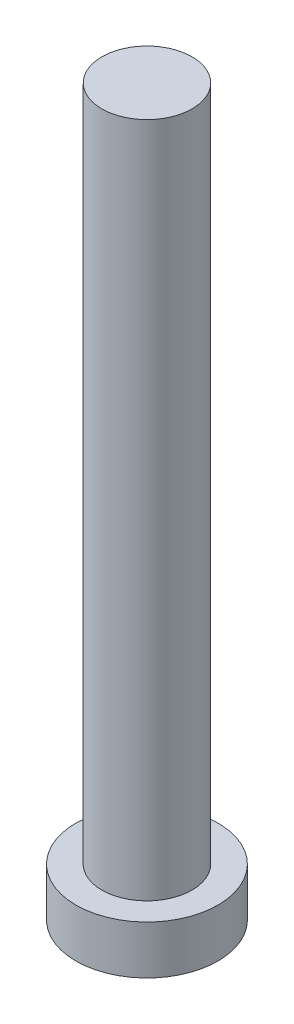
ISO-10303-21;
HEADER;
FILE_DESCRIPTION(('STEP AP214'),'2;1');
FILE_NAME('part.step','',(''),(''),'','','');
FILE_SCHEMA(('AUTOMOTIVE_DESIGN { 1 0 10303 214 1 1 1 1 }'));
ENDSEC;
DATA;
#1=APPLICATION_CONTEXT('core data for automotive mechanical design processes');
#2=APPLICATION_PROTOCOL_DEFINITION('international standard','automotive_design',2000,#1);
#3=PRODUCT_CONTEXT('',#1,'mechanical');
#4=PRODUCT('Part','Part','',(#3));
#5=PRODUCT_RELATED_PRODUCT_CATEGORY('part','',(#4));
#6=PRODUCT_DEFINITION_FORMATION('','',#4);
#7=PRODUCT_DEFINITION_CONTEXT('part definition',#1,'design');
#8=PRODUCT_DEFINITION('design','',#6,#7);
#9=PRODUCT_DEFINITION_SHAPE('','',#8);
#10=(LENGTH_UNIT() NAMED_UNIT(*) SI_UNIT(.MILLI.,.METRE.));
#11=(NAMED_UNIT(*) PLANE_ANGLE_UNIT() SI_UNIT($,.RADIAN.));
#12=(NAMED_UNIT(*) SI_UNIT($,.STERADIAN.) SOLID_ANGLE_UNIT());
#13=UNCERTAINTY_MEASURE_WITH_UNIT(LENGTH_MEASURE(1.E-05),#10,'distance_accuracy_value','');
#14=(GEOMETRIC_REPRESENTATION_CONTEXT(3) GLOBAL_UNCERTAINTY_ASSIGNED_CONTEXT((#13)) GLOBAL_UNIT_ASSIGNED_CONTEXT((#10,
#11,#12)) REPRESENTATION_CONTEXT('',''));
#15=CARTESIAN_POINT('',(0.,0.,0.));
#16=DIRECTION('',(0.,0.,1.));
#17=DIRECTION('',(1.,0.,0.));
#18=AXIS2_PLACEMENT_3D('',#15,#16,#17);
#19=CARTESIAN_POINT('',(0.,0.,0.));
#20=DIRECTION('',(0.,1.,0.));
#21=DIRECTION('',(0.,0.,1.));
#22=AXIS2_PLACEMENT_3D('',#19,#20,#21);
#23=PLANE('',#22);
#24=CARTESIAN_POINT('',(0.,0.,0.));
#25=DIRECTION('',(0.,1.,0.));
#26=DIRECTION('',(0.,0.,1.));
#27=AXIS2_PLACEMENT_3D('',#24,#25,#26);
#28=CIRCLE('',#27,3.15);
#29=CARTESIAN_POINT('',(0.,0.,3.15));
#30=VERTEX_POINT('',#29);
#31=EDGE_CURVE('E39',#30,#30,#28,.T.);
#32=ORIENTED_EDGE('',*,*,#31,.F.);
#33=EDGE_LOOP('',(#32));
#34=FACE_BOUND('',#33,.T.);
#35=CARTESIAN_POINT('',(1.,0.,1.));
#36=DIRECTION('',(0.,1.,0.));
#37=DIRECTION('',(0.,0.,-1.));
#38=AXIS2_PLACEMENT_3D('',#35,#36,#37);
#39=CIRCLE('',#38,0.5);
#40=CARTESIAN_POINT('',(1.,0.,0.5));
#41=VERTEX_POINT('',#40);
#42=CARTESIAN_POINT('',(0.5,0.,1.));
#43=VERTEX_POINT('',#42);
#44=EDGE_CURVE('E186',#41,#43,#39,.T.);
#45=ORIENTED_EDGE('',*,*,#44,.F.);
#46=DIRECTION('',(-1.,0.,0.));
#47=VECTOR('',#46,1.);
#48=CARTESIAN_POINT('',(1.,0.,0.5));
#49=LINE('',#48,#47);
#50=CARTESIAN_POINT('',(2.,0.,0.5));
#51=VERTEX_POINT('',#50);
#52=EDGE_CURVE('E52',#51,#41,#49,.T.);
#53=ORIENTED_EDGE('',*,*,#52,.F.);
#54=DIRECTION('',(0.,0.,1.));
#55=VECTOR('',#54,1.);
#56=CARTESIAN_POINT('',(2.,0.,-0.5));
#57=LINE('',#56,#55);
#58=CARTESIAN_POINT('',(2.,0.,-0.5));
#59=VERTEX_POINT('',#58);
#60=EDGE_CURVE('E225',#59,#51,#57,.T.);
#61=ORIENTED_EDGE('',*,*,#60,.F.);
#62=DIRECTION('',(1.,0.,0.));
#63=VECTOR('',#62,1.);
#64=CARTESIAN_POINT('',(1.,0.,-0.5));
#65=LINE('',#64,#63);
#66=CARTESIAN_POINT('',(1.,0.,-0.5));
#67=VERTEX_POINT('',#66);
#68=EDGE_CURVE('E223',#67,#59,#65,.T.);
#69=ORIENTED_EDGE('',*,*,#68,.F.);
#70=CARTESIAN_POINT('',(1.,0.,-1.));
#71=DIRECTION('',(0.,1.,0.));
#72=DIRECTION('',(0.,0.,-1.));
#73=AXIS2_PLACEMENT_3D('',#70,#71,#72);
#74=CIRCLE('',#73,0.5);
#75=CARTESIAN_POINT('',(0.500000000000001,0.,-1.));
#76=VERTEX_POINT('',#75);
#77=EDGE_CURVE('E160',#76,#67,#74,.T.);
#78=ORIENTED_EDGE('',*,*,#77,.F.);
#79=DIRECTION('',(0.,0.,1.));
#80=VECTOR('',#79,1.);
#81=CARTESIAN_POINT('',(0.500000000000001,0.,-2.));
#82=LINE('',#81,#80);
#83=CARTESIAN_POINT('',(0.500000000000001,0.,-2.));
#84=VERTEX_POINT('',#83);
#85=EDGE_CURVE('E219',#84,#76,#82,.T.);
#86=ORIENTED_EDGE('',*,*,#85,.F.);
#87=DIRECTION('',(1.,0.,0.));
#88=VECTOR('',#87,1.);
#89=CARTESIAN_POINT('',(-0.5,0.,-2.));
#90=LINE('',#89,#88);
#91=CARTESIAN_POINT('',(-0.5,0.,-2.));
#92=VERTEX_POINT('',#91);
#93=EDGE_CURVE('E216',#92,#84,#90,.T.);
#94=ORIENTED_EDGE('',*,*,#93,.F.);
#95=DIRECTION('',(0.,0.,-1.));
#96=VECTOR('',#95,1.);
#97=CARTESIAN_POINT('',(-0.5,0.,-2.));
#98=LINE('',#97,#96);
#99=CARTESIAN_POINT('',(-0.5,0.,-1.));
#100=VERTEX_POINT('',#99);
#101=EDGE_CURVE('E213',#100,#92,#98,.T.);
#102=ORIENTED_EDGE('',*,*,#101,.F.);
#103=CARTESIAN_POINT('',(-1.,0.,-1.));
#104=DIRECTION('',(0.,1.,0.));
#105=DIRECTION('',(0.,0.,-1.));
#106=AXIS2_PLACEMENT_3D('',#103,#104,#105);
#107=CIRCLE('',#106,0.5);
#108=CARTESIAN_POINT('',(-1.,0.,-0.5));
#109=VERTEX_POINT('',#108);
#110=EDGE_CURVE('E210',#109,#100,#107,.T.);
#111=ORIENTED_EDGE('',*,*,#110,.F.);
#112=DIRECTION('',(1.,0.,0.));
#113=VECTOR('',#112,1.);
#114=CARTESIAN_POINT('',(-2.,0.,-0.5));
#115=LINE('',#114,#113);
#116=CARTESIAN_POINT('',(-2.,0.,-0.5));
#117=VERTEX_POINT('',#116);
#118=EDGE_CURVE('E207',#117,#109,#115,.T.);
#119=ORIENTED_EDGE('',*,*,#118,.F.);
#120=DIRECTION('',(0.,0.,-1.));
#121=VECTOR('',#120,1.);
#122=CARTESIAN_POINT('',(-2.,0.,-0.5));
#123=LINE('',#122,#121);
#124=CARTESIAN_POINT('',(-2.,0.,0.5));
#125=VERTEX_POINT('',#124);
#126=EDGE_CURVE('E204',#125,#117,#123,.T.);
#127=ORIENTED_EDGE('',*,*,#126,.F.);
#128=DIRECTION('',(-1.,0.,0.));
#129=VECTOR('',#128,1.);
#130=CARTESIAN_POINT('',(-2.,0.,0.5));
#131=LINE('',#130,#129);
#132=CARTESIAN_POINT('',(-1.,0.,0.5));
#133=VERTEX_POINT('',#132);
#134=EDGE_CURVE('E201',#133,#125,#131,.T.);
#135=ORIENTED_EDGE('',*,*,#134,.F.);
#136=CARTESIAN_POINT('',(-1.,0.,1.));
#137=DIRECTION('',(0.,1.,0.));
#138=DIRECTION('',(0.,0.,1.));
#139=AXIS2_PLACEMENT_3D('',#136,#137,#138);
#140=CIRCLE('',#139,0.5);
#141=CARTESIAN_POINT('',(-0.5,0.,1.));
#142=VERTEX_POINT('',#141);
#143=EDGE_CURVE('E198',#142,#133,#140,.T.);
#144=ORIENTED_EDGE('',*,*,#143,.F.);
#145=DIRECTION('',(0.,0.,-1.));
#146=VECTOR('',#145,1.);
#147=CARTESIAN_POINT('',(-0.5,0.,1.));
#148=LINE('',#147,#146);
#149=CARTESIAN_POINT('',(-0.5,0.,2.));
#150=VERTEX_POINT('',#149);
#151=EDGE_CURVE('E195',#150,#142,#148,.T.);
#152=ORIENTED_EDGE('',*,*,#151,.F.);
#153=DIRECTION('',(-1.,0.,0.));
#154=VECTOR('',#153,1.);
#155=CARTESIAN_POINT('',(-0.5,0.,2.));
#156=LINE('',#155,#154);
#157=CARTESIAN_POINT('',(0.500000000000001,0.,2.));
#158=VERTEX_POINT('',#157);
#159=EDGE_CURVE('E192',#158,#150,#156,.T.);
#160=ORIENTED_EDGE('',*,*,#159,.F.);
#161=DIRECTION('',(0.,0.,1.));
#162=VECTOR('',#161,1.);
#163=CARTESIAN_POINT('',(0.5,0.,1.));
#164=LINE('',#163,#162);
#165=EDGE_CURVE('E189',#43,#158,#164,.T.);
#166=ORIENTED_EDGE('',*,*,#165,.F.);
#167=EDGE_LOOP('',(#45,#53,#61,#69,#78,#86,#94,#102,#111,#119,#127,#135,#144,#152,#160,#166));
#168=FACE_BOUND('',#167,.T.);
#169=ADVANCED_FACE('F35',(#34,#168),#23,.F.);
#170=CARTESIAN_POINT('',(0.,2.15,0.));
#171=DIRECTION('',(0.,-1.,0.));
#172=DIRECTION('',(0.,0.,-1.));
#173=AXIS2_PLACEMENT_3D('',#170,#171,#172);
#174=CYLINDRICAL_SURFACE('',#173,3.15);
#175=CARTESIAN_POINT('',(0.,2.15,0.));
#176=DIRECTION('',(0.,1.,0.));
#177=DIRECTION('',(0.,0.,1.));
#178=AXIS2_PLACEMENT_3D('',#175,#176,#177);
#179=CIRCLE('',#178,3.15);
#180=CARTESIAN_POINT('',(0.,2.15,3.15));
#181=VERTEX_POINT('',#180);
#182=EDGE_CURVE('E44',#181,#181,#179,.T.);
#183=ORIENTED_EDGE('',*,*,#182,.F.);
#184=EDGE_LOOP('',(#183));
#185=FACE_BOUND('',#184,.T.);
#186=ORIENTED_EDGE('',*,*,#31,.T.);
#187=EDGE_LOOP('',(#186));
#188=FACE_BOUND('',#187,.T.);
#189=ADVANCED_FACE('F37',(#185,#188),#174,.T.);
#190=CARTESIAN_POINT('',(0.,2.15,0.));
#191=DIRECTION('',(0.,1.,0.));
#192=DIRECTION('',(0.,0.,1.));
#193=AXIS2_PLACEMENT_3D('',#190,#191,#192);
#194=PLANE('',#193);
#195=CARTESIAN_POINT('',(0.,2.15,0.));
#196=DIRECTION('',(0.,1.,0.));
#197=DIRECTION('',(0.,0.,1.));
#198=AXIS2_PLACEMENT_3D('',#195,#196,#197);
#199=CIRCLE('',#198,2.);
#200=CARTESIAN_POINT('',(0.,2.15,2.));
#201=VERTEX_POINT('',#200);
#202=EDGE_CURVE('E11',#201,#201,#199,.T.);
#203=ORIENTED_EDGE('',*,*,#202,.F.);
#204=EDGE_LOOP('',(#203));
#205=FACE_BOUND('',#204,.T.);
#206=ORIENTED_EDGE('',*,*,#182,.T.);
#207=EDGE_LOOP('',(#206));
#208=FACE_BOUND('',#207,.T.);
#209=ADVANCED_FACE('F374',(#205,#208),#194,.T.);
#210=CARTESIAN_POINT('',(0.,32.15,0.));
#211=DIRECTION('',(0.,-1.,0.));
#212=DIRECTION('',(0.,0.,-1.));
#213=AXIS2_PLACEMENT_3D('',#210,#211,#212);
#214=CYLINDRICAL_SURFACE('',#213,2.);
#215=CARTESIAN_POINT('',(0.,32.15,0.));
#216=DIRECTION('',(0.,1.,0.));
#217=DIRECTION('',(0.,0.,1.));
#218=AXIS2_PLACEMENT_3D('',#215,#216,#217);
#219=CIRCLE('',#218,2.);
#220=CARTESIAN_POINT('',(0.,32.15,2.));
#221=VERTEX_POINT('',#220);
#222=EDGE_CURVE('E229',#221,#221,#219,.T.);
#223=ORIENTED_EDGE('',*,*,#222,.F.);
#224=EDGE_LOOP('',(#223));
#225=FACE_BOUND('',#224,.T.);
#226=ORIENTED_EDGE('',*,*,#202,.T.);
#227=EDGE_LOOP('',(#226));
#228=FACE_BOUND('',#227,.T.);
#229=ADVANCED_FACE('F370',(#225,#228),#214,.T.);
#230=CARTESIAN_POINT('',(0.,32.15,0.));
#231=DIRECTION('',(0.,1.,0.));
#232=DIRECTION('',(0.,0.,1.));
#233=AXIS2_PLACEMENT_3D('',#230,#231,#232);
#234=PLANE('',#233);
#235=ORIENTED_EDGE('',*,*,#222,.T.);
#236=EDGE_LOOP('',(#235));
#237=FACE_BOUND('',#236,.T.);
#238=ADVANCED_FACE('F320',(#237),#234,.T.);
#239=CARTESIAN_POINT('',(1.,1.5,0.5));
#240=DIRECTION('',(0.,0.,1.));
#241=DIRECTION('',(1.,0.,0.));
#242=AXIS2_PLACEMENT_3D('',#239,#240,#241);
#243=PLANE('',#242);
#244=ORIENTED_EDGE('',*,*,#52,.T.);
#245=DIRECTION('',(0.,-1.,0.));
#246=VECTOR('',#245,1.);
#247=CARTESIAN_POINT('',(1.,1.5,0.5));
#248=LINE('',#247,#246);
#249=CARTESIAN_POINT('',(1.,1.5,0.5));
#250=VERTEX_POINT('',#249);
#251=EDGE_CURVE('E112',#250,#41,#248,.T.);
#252=ORIENTED_EDGE('',*,*,#251,.F.);
#253=DIRECTION('',(-1.,0.,0.));
#254=VECTOR('',#253,1.);
#255=CARTESIAN_POINT('',(1.,1.5,0.5));
#256=LINE('',#255,#254);
#257=CARTESIAN_POINT('',(2.,1.5,0.5));
#258=VERTEX_POINT('',#257);
#259=EDGE_CURVE('E227',#258,#250,#256,.T.);
#260=ORIENTED_EDGE('',*,*,#259,.F.);
#261=DIRECTION('',(0.,-1.,0.));
#262=VECTOR('',#261,1.);
#263=CARTESIAN_POINT('',(2.,1.5,0.5));
#264=LINE('',#263,#262);
#265=EDGE_CURVE('E60',#258,#51,#264,.T.);
#266=ORIENTED_EDGE('',*,*,#265,.T.);
#267=EDGE_LOOP('',(#244,#252,#260,#266));
#268=FACE_BOUND('',#267,.T.);
#269=ADVANCED_FACE('F313',(#268),#243,.F.);
#270=CARTESIAN_POINT('',(2.,1.5,-0.5));
#271=DIRECTION('',(1.,0.,0.));
#272=DIRECTION('',(0.,0.,-1.));
#273=AXIS2_PLACEMENT_3D('',#270,#271,#272);
#274=PLANE('',#273);
#275=ORIENTED_EDGE('',*,*,#60,.T.);
#276=ORIENTED_EDGE('',*,*,#265,.F.);
#277=DIRECTION('',(0.,0.,1.));
#278=VECTOR('',#277,1.);
#279=CARTESIAN_POINT('',(2.,1.5,-0.5));
#280=LINE('',#279,#278);
#281=CARTESIAN_POINT('',(2.,1.5,-0.5));
#282=VERTEX_POINT('',#281);
#283=EDGE_CURVE('E172',#282,#258,#280,.T.);
#284=ORIENTED_EDGE('',*,*,#283,.F.);
#285=DIRECTION('',(0.,-1.,0.));
#286=VECTOR('',#285,1.);
#287=CARTESIAN_POINT('',(2.,1.5,-0.5));
#288=LINE('',#287,#286);
#289=EDGE_CURVE('E164',#282,#59,#288,.T.);
#290=ORIENTED_EDGE('',*,*,#289,.T.);
#291=EDGE_LOOP('',(#275,#276,#284,#290));
#292=FACE_BOUND('',#291,.T.);
#293=ADVANCED_FACE('F311',(#292),#274,.F.);
#294=CARTESIAN_POINT('',(1.,1.5,-0.5));
#295=DIRECTION('',(0.,0.,-1.));
#296=DIRECTION('',(-1.,0.,0.));
#297=AXIS2_PLACEMENT_3D('',#294,#295,#296);
#298=PLANE('',#297);
#299=ORIENTED_EDGE('',*,*,#68,.T.);
#300=ORIENTED_EDGE('',*,*,#289,.F.);
#301=DIRECTION('',(1.,0.,0.));
#302=VECTOR('',#301,1.);
#303=CARTESIAN_POINT('',(1.,1.5,-0.5));
#304=LINE('',#303,#302);
#305=CARTESIAN_POINT('',(1.,1.5,-0.5));
#306=VERTEX_POINT('',#305);
#307=EDGE_CURVE('E168',#306,#282,#304,.T.);
#308=ORIENTED_EDGE('',*,*,#307,.F.);
#309=DIRECTION('',(0.,-1.,0.));
#310=VECTOR('',#309,1.);
#311=CARTESIAN_POINT('',(1.,1.5,-0.5));
#312=LINE('',#311,#310);
#313=EDGE_CURVE('E153',#306,#67,#312,.T.);
#314=ORIENTED_EDGE('',*,*,#313,.T.);
#315=EDGE_LOOP('',(#299,#300,#308,#314));
#316=FACE_BOUND('',#315,.T.);
#317=ADVANCED_FACE('F169',(#316),#298,.F.);
#318=CARTESIAN_POINT('',(1.,1.5,-1.));
#319=DIRECTION('',(0.,-1.,0.));
#320=DIRECTION('',(0.,0.,-1.));
#321=AXIS2_PLACEMENT_3D('',#318,#319,#320);
#322=CYLINDRICAL_SURFACE('',#321,0.5);
#323=ORIENTED_EDGE('',*,*,#77,.T.);
#324=ORIENTED_EDGE('',*,*,#313,.F.);
#325=CARTESIAN_POINT('',(1.,1.5,-1.));
#326=DIRECTION('',(0.,1.,0.));
#327=DIRECTION('',(0.,0.,-1.));
#328=AXIS2_PLACEMENT_3D('',#325,#326,#327);
#329=CIRCLE('',#328,0.5);
#330=CARTESIAN_POINT('',(0.500000000000001,1.5,-1.));
#331=VERTEX_POINT('',#330);
#332=EDGE_CURVE('E157',#331,#306,#329,.T.);
#333=ORIENTED_EDGE('',*,*,#332,.F.);
#334=DIRECTION('',(0.,-1.,0.));
#335=VECTOR('',#334,1.);
#336=CARTESIAN_POINT('',(0.500000000000001,1.5,-1.));
#337=LINE('',#336,#335);
#338=EDGE_CURVE('E165',#331,#76,#337,.T.);
#339=ORIENTED_EDGE('',*,*,#338,.T.);
#340=EDGE_LOOP('',(#323,#324,#333,#339));
#341=FACE_BOUND('',#340,.T.);
#342=ADVANCED_FACE('F155',(#341),#322,.T.);
#343=CARTESIAN_POINT('',(0.500000000000001,1.5,-2.));
#344=DIRECTION('',(1.,0.,0.));
#345=DIRECTION('',(0.,0.,-1.));
#346=AXIS2_PLACEMENT_3D('',#343,#344,#345);
#347=PLANE('',#346);
#348=ORIENTED_EDGE('',*,*,#85,.T.);
#349=ORIENTED_EDGE('',*,*,#338,.F.);
#350=DIRECTION('',(0.,0.,1.));
#351=VECTOR('',#350,1.);
#352=CARTESIAN_POINT('',(0.500000000000001,1.5,-2.));
#353=LINE('',#352,#351);
#354=CARTESIAN_POINT('',(0.500000000000001,1.5,-2.));
#355=VERTEX_POINT('',#354);
#356=EDGE_CURVE('E178',#355,#331,#353,.T.);
#357=ORIENTED_EDGE('',*,*,#356,.F.);
#358=DIRECTION('',(0.,-1.,0.));
#359=VECTOR('',#358,1.);
#360=CARTESIAN_POINT('',(0.500000000000001,1.5,-2.));
#361=LINE('',#360,#359);
#362=EDGE_CURVE('E232',#355,#84,#361,.T.);
#363=ORIENTED_EDGE('',*,*,#362,.T.);
#364=EDGE_LOOP('',(#348,#349,#357,#363));
#365=FACE_BOUND('',#364,.T.);
#366=ADVANCED_FACE('F310',(#365),#347,.F.);
#367=CARTESIAN_POINT('',(-0.5,1.5,-2.));
#368=DIRECTION('',(0.,0.,-1.));
#369=DIRECTION('',(-1.,0.,0.));
#370=AXIS2_PLACEMENT_3D('',#367,#368,#369);
#371=PLANE('',#370);
#372=ORIENTED_EDGE('',*,*,#93,.T.);
#373=ORIENTED_EDGE('',*,*,#362,.F.);
#374=DIRECTION('',(1.,0.,0.));
#375=VECTOR('',#374,1.);
#376=CARTESIAN_POINT('',(-0.5,1.5,-2.));
#377=LINE('',#376,#375);
#378=CARTESIAN_POINT('',(-0.5,1.5,-2.));
#379=VERTEX_POINT('',#378);
#380=EDGE_CURVE('E180',#379,#355,#377,.T.);
#381=ORIENTED_EDGE('',*,*,#380,.F.);
#382=DIRECTION('',(0.,-1.,0.));
#383=VECTOR('',#382,1.);
#384=CARTESIAN_POINT('',(-0.5,1.5,-2.));
#385=LINE('',#384,#383);
#386=EDGE_CURVE('E234',#379,#92,#385,.T.);
#387=ORIENTED_EDGE('',*,*,#386,.T.);
#388=EDGE_LOOP('',(#372,#373,#381,#387));
#389=FACE_BOUND('',#388,.T.);
#390=ADVANCED_FACE('F306',(#389),#371,.F.);
#391=CARTESIAN_POINT('',(-0.5,1.5,-2.));
#392=DIRECTION('',(-1.,0.,0.));
#393=DIRECTION('',(0.,0.,1.));
#394=AXIS2_PLACEMENT_3D('',#391,#392,#393);
#395=PLANE('',#394);
#396=ORIENTED_EDGE('',*,*,#101,.T.);
#397=ORIENTED_EDGE('',*,*,#386,.F.);
#398=DIRECTION('',(0.,0.,-1.));
#399=VECTOR('',#398,1.);
#400=CARTESIAN_POINT('',(-0.5,1.5,-2.));
#401=LINE('',#400,#399);
#402=CARTESIAN_POINT('',(-0.5,1.5,-1.));
#403=VERTEX_POINT('',#402);
#404=EDGE_CURVE('E301',#403,#379,#401,.T.);
#405=ORIENTED_EDGE('',*,*,#404,.F.);
#406=DIRECTION('',(0.,-1.,0.));
#407=VECTOR('',#406,1.);
#408=CARTESIAN_POINT('',(-0.5,1.5,-1.));
#409=LINE('',#408,#407);
#410=EDGE_CURVE('E236',#403,#100,#409,.T.);
#411=ORIENTED_EDGE('',*,*,#410,.T.);
#412=EDGE_LOOP('',(#396,#397,#405,#411));
#413=FACE_BOUND('',#412,.T.);
#414=ADVANCED_FACE('F330',(#413),#395,.F.);
#415=CARTESIAN_POINT('',(-1.,1.5,-1.));
#416=DIRECTION('',(0.,-1.,0.));
#417=DIRECTION('',(0.,0.,-1.));
#418=AXIS2_PLACEMENT_3D('',#415,#416,#417);
#419=CYLINDRICAL_SURFACE('',#418,0.5);
#420=ORIENTED_EDGE('',*,*,#110,.T.);
#421=ORIENTED_EDGE('',*,*,#410,.F.);
#422=CARTESIAN_POINT('',(-1.,1.5,-1.));
#423=DIRECTION('',(0.,1.,0.));
#424=DIRECTION('',(0.,0.,-1.));
#425=AXIS2_PLACEMENT_3D('',#422,#423,#424);
#426=CIRCLE('',#425,0.5);
#427=CARTESIAN_POINT('',(-1.,1.5,-0.5));
#428=VERTEX_POINT('',#427);
#429=EDGE_CURVE('E298',#428,#403,#426,.T.);
#430=ORIENTED_EDGE('',*,*,#429,.F.);
#431=DIRECTION('',(0.,-1.,0.));
#432=VECTOR('',#431,1.);
#433=CARTESIAN_POINT('',(-1.,1.5,-0.5));
#434=LINE('',#433,#432);
#435=EDGE_CURVE('E238',#428,#109,#434,.T.);
#436=ORIENTED_EDGE('',*,*,#435,.T.);
#437=EDGE_LOOP('',(#420,#421,#430,#436));
#438=FACE_BOUND('',#437,.T.);
#439=ADVANCED_FACE('F333',(#438),#419,.T.);
#440=CARTESIAN_POINT('',(-2.,1.5,-0.5));
#441=DIRECTION('',(0.,0.,-1.));
#442=DIRECTION('',(-1.,0.,0.));
#443=AXIS2_PLACEMENT_3D('',#440,#441,#442);
#444=PLANE('',#443);
#445=ORIENTED_EDGE('',*,*,#118,.T.);
#446=ORIENTED_EDGE('',*,*,#435,.F.);
#447=DIRECTION('',(1.,0.,0.));
#448=VECTOR('',#447,1.);
#449=CARTESIAN_POINT('',(-2.,1.5,-0.5));
#450=LINE('',#449,#448);
#451=CARTESIAN_POINT('',(-2.,1.5,-0.5));
#452=VERTEX_POINT('',#451);
#453=EDGE_CURVE('E295',#452,#428,#450,.T.);
#454=ORIENTED_EDGE('',*,*,#453,.F.);
#455=DIRECTION('',(0.,-1.,0.));
#456=VECTOR('',#455,1.);
#457=CARTESIAN_POINT('',(-2.,1.5,-0.5));
#458=LINE('',#457,#456);
#459=EDGE_CURVE('E240',#452,#117,#458,.T.);
#460=ORIENTED_EDGE('',*,*,#459,.T.);
#461=EDGE_LOOP('',(#445,#446,#454,#460));
#462=FACE_BOUND('',#461,.T.);
#463=ADVANCED_FACE('F337',(#462),#444,.F.);
#464=CARTESIAN_POINT('',(-2.,1.5,-0.5));
#465=DIRECTION('',(-1.,0.,0.));
#466=DIRECTION('',(0.,0.,1.));
#467=AXIS2_PLACEMENT_3D('',#464,#465,#466);
#468=PLANE('',#467);
#469=ORIENTED_EDGE('',*,*,#126,.T.);
#470=ORIENTED_EDGE('',*,*,#459,.F.);
#471=DIRECTION('',(0.,0.,-1.));
#472=VECTOR('',#471,1.);
#473=CARTESIAN_POINT('',(-2.,1.5,-0.5));
#474=LINE('',#473,#472);
#475=CARTESIAN_POINT('',(-2.,1.5,0.5));
#476=VERTEX_POINT('',#475);
#477=EDGE_CURVE('E292',#476,#452,#474,.T.);
#478=ORIENTED_EDGE('',*,*,#477,.F.);
#479=DIRECTION('',(0.,-1.,0.));
#480=VECTOR('',#479,1.);
#481=CARTESIAN_POINT('',(-2.,1.5,0.5));
#482=LINE('',#481,#480);
#483=EDGE_CURVE('E242',#476,#125,#482,.T.);
#484=ORIENTED_EDGE('',*,*,#483,.T.);
#485=EDGE_LOOP('',(#469,#470,#478,#484));
#486=FACE_BOUND('',#485,.T.);
#487=ADVANCED_FACE('F341',(#486),#468,.F.);
#488=CARTESIAN_POINT('',(-2.,1.5,0.5));
#489=DIRECTION('',(0.,0.,1.));
#490=DIRECTION('',(1.,0.,0.));
#491=AXIS2_PLACEMENT_3D('',#488,#489,#490);
#492=PLANE('',#491);
#493=ORIENTED_EDGE('',*,*,#134,.T.);
#494=ORIENTED_EDGE('',*,*,#483,.F.);
#495=DIRECTION('',(-1.,0.,0.));
#496=VECTOR('',#495,1.);
#497=CARTESIAN_POINT('',(-2.,1.5,0.5));
#498=LINE('',#497,#496);
#499=CARTESIAN_POINT('',(-1.,1.5,0.5));
#500=VERTEX_POINT('',#499);
#501=EDGE_CURVE('E289',#500,#476,#498,.T.);
#502=ORIENTED_EDGE('',*,*,#501,.F.);
#503=DIRECTION('',(0.,-1.,0.));
#504=VECTOR('',#503,1.);
#505=CARTESIAN_POINT('',(-1.,1.5,0.5));
#506=LINE('',#505,#504);
#507=EDGE_CURVE('E244',#500,#133,#506,.T.);
#508=ORIENTED_EDGE('',*,*,#507,.T.);
#509=EDGE_LOOP('',(#493,#494,#502,#508));
#510=FACE_BOUND('',#509,.T.);
#511=ADVANCED_FACE('F345',(#510),#492,.F.);
#512=CARTESIAN_POINT('',(-1.,1.5,1.));
#513=DIRECTION('',(0.,-1.,0.));
#514=DIRECTION('',(0.,0.,-1.));
#515=AXIS2_PLACEMENT_3D('',#512,#513,#514);
#516=CYLINDRICAL_SURFACE('',#515,0.5);
#517=ORIENTED_EDGE('',*,*,#143,.T.);
#518=ORIENTED_EDGE('',*,*,#507,.F.);
#519=CARTESIAN_POINT('',(-1.,1.5,1.));
#520=DIRECTION('',(0.,1.,0.));
#521=DIRECTION('',(0.,0.,1.));
#522=AXIS2_PLACEMENT_3D('',#519,#520,#521);
#523=CIRCLE('',#522,0.5);
#524=CARTESIAN_POINT('',(-0.5,1.5,1.));
#525=VERTEX_POINT('',#524);
#526=EDGE_CURVE('E286',#525,#500,#523,.T.);
#527=ORIENTED_EDGE('',*,*,#526,.F.);
#528=DIRECTION('',(0.,-1.,0.));
#529=VECTOR('',#528,1.);
#530=CARTESIAN_POINT('',(-0.5,1.5,1.));
#531=LINE('',#530,#529);
#532=EDGE_CURVE('E246',#525,#142,#531,.T.);
#533=ORIENTED_EDGE('',*,*,#532,.T.);
#534=EDGE_LOOP('',(#517,#518,#527,#533));
#535=FACE_BOUND('',#534,.T.);
#536=ADVANCED_FACE('F349',(#535),#516,.T.);
#537=CARTESIAN_POINT('',(-0.5,1.5,1.));
#538=DIRECTION('',(-1.,0.,0.));
#539=DIRECTION('',(0.,0.,1.));
#540=AXIS2_PLACEMENT_3D('',#537,#538,#539);
#541=PLANE('',#540);
#542=ORIENTED_EDGE('',*,*,#151,.T.);
#543=ORIENTED_EDGE('',*,*,#532,.F.);
#544=DIRECTION('',(0.,0.,-1.));
#545=VECTOR('',#544,1.);
#546=CARTESIAN_POINT('',(-0.5,1.5,1.));
#547=LINE('',#546,#545);
#548=CARTESIAN_POINT('',(-0.5,1.5,2.));
#549=VERTEX_POINT('',#548);
#550=EDGE_CURVE('E283',#549,#525,#547,.T.);
#551=ORIENTED_EDGE('',*,*,#550,.F.);
#552=DIRECTION('',(0.,-1.,0.));
#553=VECTOR('',#552,1.);
#554=CARTESIAN_POINT('',(-0.5,1.5,2.));
#555=LINE('',#554,#553);
#556=EDGE_CURVE('E248',#549,#150,#555,.T.);
#557=ORIENTED_EDGE('',*,*,#556,.T.);
#558=EDGE_LOOP('',(#542,#543,#551,#557));
#559=FACE_BOUND('',#558,.T.);
#560=ADVANCED_FACE('F353',(#559),#541,.F.);
#561=CARTESIAN_POINT('',(-0.5,1.5,2.));
#562=DIRECTION('',(0.,0.,1.));
#563=DIRECTION('',(1.,0.,0.));
#564=AXIS2_PLACEMENT_3D('',#561,#562,#563);
#565=PLANE('',#564);
#566=ORIENTED_EDGE('',*,*,#159,.T.);
#567=ORIENTED_EDGE('',*,*,#556,.F.);
#568=DIRECTION('',(-1.,0.,0.));
#569=VECTOR('',#568,1.);
#570=CARTESIAN_POINT('',(-0.5,1.5,2.));
#571=LINE('',#570,#569);
#572=CARTESIAN_POINT('',(0.500000000000001,1.5,2.));
#573=VERTEX_POINT('',#572);
#574=EDGE_CURVE('E280',#573,#549,#571,.T.);
#575=ORIENTED_EDGE('',*,*,#574,.F.);
#576=DIRECTION('',(0.,-1.,0.));
#577=VECTOR('',#576,1.);
#578=CARTESIAN_POINT('',(0.500000000000001,1.5,2.));
#579=LINE('',#578,#577);
#580=EDGE_CURVE('E250',#573,#158,#579,.T.);
#581=ORIENTED_EDGE('',*,*,#580,.T.);
#582=EDGE_LOOP('',(#566,#567,#575,#581));
#583=FACE_BOUND('',#582,.T.);
#584=ADVANCED_FACE('F357',(#583),#565,.F.);
#585=CARTESIAN_POINT('',(0.5,1.5,1.));
#586=DIRECTION('',(1.,0.,0.));
#587=DIRECTION('',(0.,0.,-1.));
#588=AXIS2_PLACEMENT_3D('',#585,#586,#587);
#589=PLANE('',#588);
#590=ORIENTED_EDGE('',*,*,#165,.T.);
#591=ORIENTED_EDGE('',*,*,#580,.F.);
#592=DIRECTION('',(0.,0.,1.));
#593=VECTOR('',#592,1.);
#594=CARTESIAN_POINT('',(0.5,1.5,1.));
#595=LINE('',#594,#593);
#596=CARTESIAN_POINT('',(0.5,1.5,1.));
#597=VERTEX_POINT('',#596);
#598=EDGE_CURVE('E275',#597,#573,#595,.T.);
#599=ORIENTED_EDGE('',*,*,#598,.F.);
#600=DIRECTION('',(0.,-1.,0.));
#601=VECTOR('',#600,1.);
#602=CARTESIAN_POINT('',(0.5,1.5,1.));
#603=LINE('',#602,#601);
#604=EDGE_CURVE('E252',#597,#43,#603,.T.);
#605=ORIENTED_EDGE('',*,*,#604,.T.);
#606=EDGE_LOOP('',(#590,#591,#599,#605));
#607=FACE_BOUND('',#606,.T.);
#608=ADVANCED_FACE('F361',(#607),#589,.F.);
#609=CARTESIAN_POINT('',(1.,1.5,1.));
#610=DIRECTION('',(0.,-1.,0.));
#611=DIRECTION('',(0.,0.,-1.));
#612=AXIS2_PLACEMENT_3D('',#609,#610,#611);
#613=CYLINDRICAL_SURFACE('',#612,0.5);
#614=ORIENTED_EDGE('',*,*,#44,.T.);
#615=ORIENTED_EDGE('',*,*,#604,.F.);
#616=CARTESIAN_POINT('',(1.,1.5,1.));
#617=DIRECTION('',(0.,1.,0.));
#618=DIRECTION('',(0.,0.,-1.));
#619=AXIS2_PLACEMENT_3D('',#616,#617,#618);
#620=CIRCLE('',#619,0.5);
#621=EDGE_CURVE('E273',#250,#597,#620,.T.);
#622=ORIENTED_EDGE('',*,*,#621,.F.);
#623=ORIENTED_EDGE('',*,*,#251,.T.);
#624=EDGE_LOOP('',(#614,#615,#622,#623));
#625=FACE_BOUND('',#624,.T.);
#626=ADVANCED_FACE('F270',(#625),#613,.T.);
#627=CARTESIAN_POINT('',(1.,1.5,-1.));
#628=DIRECTION('',(0.,-1.,0.));
#629=DIRECTION('',(0.,0.,-1.));
#630=AXIS2_PLACEMENT_3D('',#627,#628,#629);
#631=PLANE('',#630);
#632=ORIENTED_EDGE('',*,*,#259,.T.);
#633=ORIENTED_EDGE('',*,*,#621,.T.);
#634=ORIENTED_EDGE('',*,*,#598,.T.);
#635=ORIENTED_EDGE('',*,*,#574,.T.);
#636=ORIENTED_EDGE('',*,*,#550,.T.);
#637=ORIENTED_EDGE('',*,*,#526,.T.);
#638=ORIENTED_EDGE('',*,*,#501,.T.);
#639=ORIENTED_EDGE('',*,*,#477,.T.);
#640=ORIENTED_EDGE('',*,*,#453,.T.);
#641=ORIENTED_EDGE('',*,*,#429,.T.);
#642=ORIENTED_EDGE('',*,*,#404,.T.);
#643=ORIENTED_EDGE('',*,*,#380,.T.);
#644=ORIENTED_EDGE('',*,*,#356,.T.);
#645=ORIENTED_EDGE('',*,*,#332,.T.);
#646=ORIENTED_EDGE('',*,*,#307,.T.);
#647=ORIENTED_EDGE('',*,*,#283,.T.);
#648=EDGE_LOOP('',(#632,#633,#634,#635,#636,#637,#638,#639,#640,#641,#642,#643,#644,#645,#646,#647));
#649=FACE_BOUND('',#648,.T.);
#650=ADVANCED_FACE('F175',(#649),#631,.T.);
#651=CLOSED_SHELL('',(#169,#189,#209,#229,#238,#269,#293,#317,#342,#366,#390,#414,#439,#463,
#487,#511,#536,#560,#584,#608,#626,#650));
#652=MANIFOLD_SOLID_BREP('B2',#651);
#653=ADVANCED_BREP_SHAPE_REPRESENTATION('',(#18,#652),#14);
#654=SHAPE_DEFINITION_REPRESENTATION(#9,#653);
ENDSEC;
END-ISO-10303-21;
